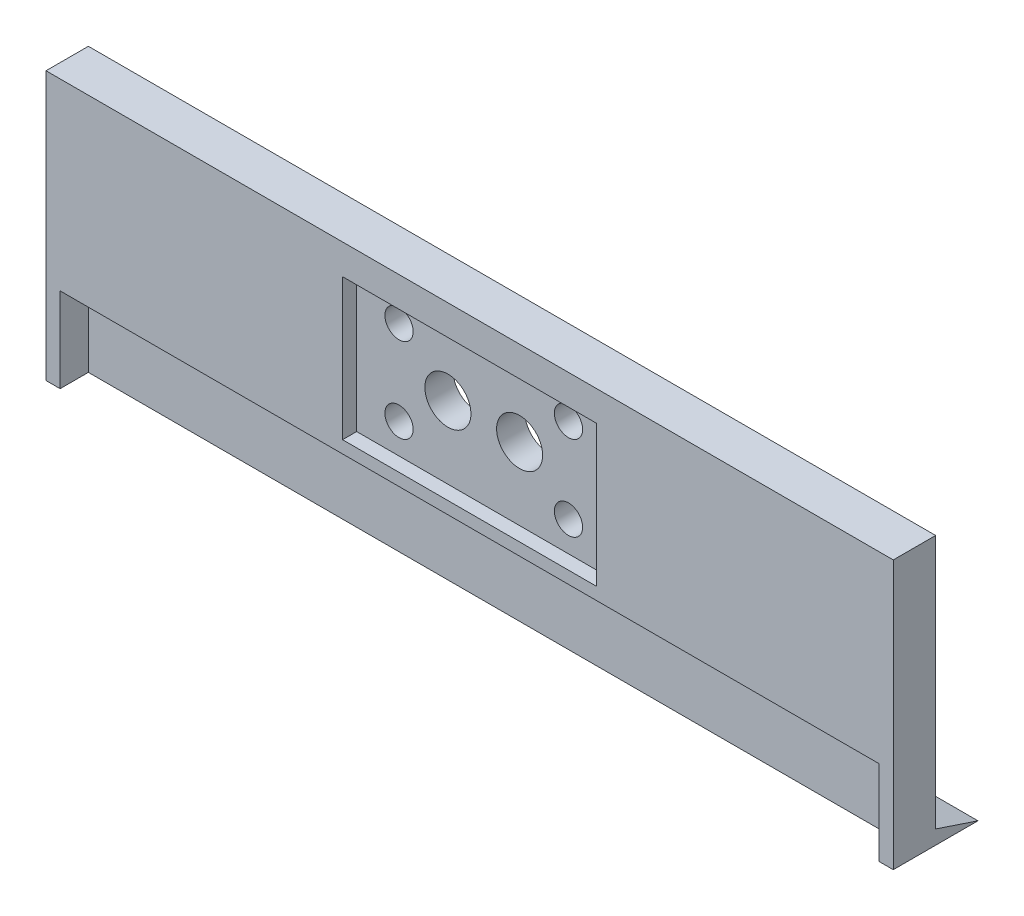
ISO-10303-21;
HEADER;
FILE_DESCRIPTION(('STEP AP214'),'2;1');
FILE_NAME('part.step','',(''),(''),'','','');
FILE_SCHEMA(('AUTOMOTIVE_DESIGN { 1 0 10303 214 1 1 1 1 }'));
ENDSEC;
DATA;
#1=APPLICATION_CONTEXT('core data for automotive mechanical design processes');
#2=APPLICATION_PROTOCOL_DEFINITION('international standard','automotive_design',2000,#1);
#3=PRODUCT_CONTEXT('',#1,'mechanical');
#4=PRODUCT('Part','Part','',(#3));
#5=PRODUCT_RELATED_PRODUCT_CATEGORY('part','',(#4));
#6=PRODUCT_DEFINITION_FORMATION('','',#4);
#7=PRODUCT_DEFINITION_CONTEXT('part definition',#1,'design');
#8=PRODUCT_DEFINITION('design','',#6,#7);
#9=PRODUCT_DEFINITION_SHAPE('','',#8);
#10=(LENGTH_UNIT() NAMED_UNIT(*) SI_UNIT(.MILLI.,.METRE.));
#11=(NAMED_UNIT(*) PLANE_ANGLE_UNIT() SI_UNIT($,.RADIAN.));
#12=(NAMED_UNIT(*) SI_UNIT($,.STERADIAN.) SOLID_ANGLE_UNIT());
#13=UNCERTAINTY_MEASURE_WITH_UNIT(LENGTH_MEASURE(1.E-05),#10,'distance_accuracy_value','');
#14=(GEOMETRIC_REPRESENTATION_CONTEXT(3) GLOBAL_UNCERTAINTY_ASSIGNED_CONTEXT((#13)) GLOBAL_UNIT_ASSIGNED_CONTEXT((#10,
#11,#12)) REPRESENTATION_CONTEXT('',''));
#15=CARTESIAN_POINT('',(0.,0.,0.));
#16=DIRECTION('',(0.,0.,1.));
#17=DIRECTION('',(1.,0.,0.));
#18=AXIS2_PLACEMENT_3D('',#15,#16,#17);
#19=CARTESIAN_POINT('',(162.7,60.,15.));
#20=DIRECTION('',(0.,0.,-1.));
#21=DIRECTION('',(-1.,0.,0.));
#22=AXIS2_PLACEMENT_3D('',#19,#20,#21);
#23=CYLINDRICAL_SURFACE('',#22,8.15000000000003);
#24=CARTESIAN_POINT('',(162.7,60.,0.));
#25=DIRECTION('',(0.,0.,-1.));
#26=DIRECTION('',(-1.,0.,0.));
#27=AXIS2_PLACEMENT_3D('',#24,#25,#26);
#28=CIRCLE('',#27,8.15000000000003);
#29=CARTESIAN_POINT('',(154.55,60.,0.));
#30=VERTEX_POINT('',#29);
#31=EDGE_CURVE('E228',#30,#30,#28,.T.);
#32=ORIENTED_EDGE('',*,*,#31,.T.);
#33=EDGE_LOOP('',(#32));
#34=FACE_BOUND('',#33,.T.);
#35=CARTESIAN_POINT('',(162.7,60.,10.));
#36=DIRECTION('',(0.,0.,1.));
#37=DIRECTION('',(1.,0.,0.));
#38=AXIS2_PLACEMENT_3D('',#35,#36,#37);
#39=CIRCLE('',#38,8.15000000000003);
#40=CARTESIAN_POINT('',(170.85,60.,10.));
#41=VERTEX_POINT('',#40);
#42=EDGE_CURVE('E193',#41,#41,#39,.F.);
#43=ORIENTED_EDGE('',*,*,#42,.F.);
#44=EDGE_LOOP('',(#43));
#45=FACE_BOUND('',#44,.T.);
#46=ADVANCED_FACE('F46',(#34,#45),#23,.F.);
#47=CARTESIAN_POINT('',(137.3,60.,15.));
#48=DIRECTION('',(0.,0.,-1.));
#49=DIRECTION('',(-1.,0.,0.));
#50=AXIS2_PLACEMENT_3D('',#47,#48,#49);
#51=CYLINDRICAL_SURFACE('',#50,8.15);
#52=CARTESIAN_POINT('',(137.3,60.,0.));
#53=DIRECTION('',(0.,0.,-1.));
#54=DIRECTION('',(-1.,0.,0.));
#55=AXIS2_PLACEMENT_3D('',#52,#53,#54);
#56=CIRCLE('',#55,8.15);
#57=CARTESIAN_POINT('',(129.15,60.,0.));
#58=VERTEX_POINT('',#57);
#59=EDGE_CURVE('E225',#58,#58,#56,.T.);
#60=ORIENTED_EDGE('',*,*,#59,.T.);
#61=EDGE_LOOP('',(#60));
#62=FACE_BOUND('',#61,.T.);
#63=CARTESIAN_POINT('',(137.3,60.,10.));
#64=DIRECTION('',(0.,0.,1.));
#65=DIRECTION('',(1.,0.,0.));
#66=AXIS2_PLACEMENT_3D('',#63,#64,#65);
#67=CIRCLE('',#66,8.15);
#68=CARTESIAN_POINT('',(145.45,60.,10.));
#69=VERTEX_POINT('',#68);
#70=EDGE_CURVE('E190',#69,#69,#67,.F.);
#71=ORIENTED_EDGE('',*,*,#70,.F.);
#72=EDGE_LOOP('',(#71));
#73=FACE_BOUND('',#72,.T.);
#74=ADVANCED_FACE('F338',(#62,#73),#51,.F.);
#75=CARTESIAN_POINT('',(180.,75.,15.));
#76=DIRECTION('',(0.,0.,-1.));
#77=DIRECTION('',(-1.,0.,0.));
#78=AXIS2_PLACEMENT_3D('',#75,#76,#77);
#79=CYLINDRICAL_SURFACE('',#78,5.00000000000002);
#80=CARTESIAN_POINT('',(180.,75.,0.));
#81=DIRECTION('',(0.,0.,-1.));
#82=DIRECTION('',(-1.,0.,0.));
#83=AXIS2_PLACEMENT_3D('',#80,#81,#82);
#84=CIRCLE('',#83,5.00000000000002);
#85=CARTESIAN_POINT('',(175.,75.,0.));
#86=VERTEX_POINT('',#85);
#87=EDGE_CURVE('E222',#86,#86,#84,.T.);
#88=ORIENTED_EDGE('',*,*,#87,.T.);
#89=EDGE_LOOP('',(#88));
#90=FACE_BOUND('',#89,.T.);
#91=CARTESIAN_POINT('',(180.,75.,10.));
#92=DIRECTION('',(0.,0.,1.));
#93=DIRECTION('',(1.,0.,0.));
#94=AXIS2_PLACEMENT_3D('',#91,#92,#93);
#95=CIRCLE('',#94,5.00000000000002);
#96=CARTESIAN_POINT('',(185.,75.,10.));
#97=VERTEX_POINT('',#96);
#98=EDGE_CURVE('E187',#97,#97,#95,.F.);
#99=ORIENTED_EDGE('',*,*,#98,.F.);
#100=EDGE_LOOP('',(#99));
#101=FACE_BOUND('',#100,.T.);
#102=ADVANCED_FACE('F344',(#90,#101),#79,.F.);
#103=CARTESIAN_POINT('',(180.,45.,15.));
#104=DIRECTION('',(0.,0.,-1.));
#105=DIRECTION('',(-1.,0.,0.));
#106=AXIS2_PLACEMENT_3D('',#103,#104,#105);
#107=CYLINDRICAL_SURFACE('',#106,5.00000000000002);
#108=CARTESIAN_POINT('',(180.,45.,0.));
#109=DIRECTION('',(0.,0.,-1.));
#110=DIRECTION('',(-1.,0.,0.));
#111=AXIS2_PLACEMENT_3D('',#108,#109,#110);
#112=CIRCLE('',#111,5.00000000000002);
#113=CARTESIAN_POINT('',(175.,45.,0.));
#114=VERTEX_POINT('',#113);
#115=EDGE_CURVE('E219',#114,#114,#112,.T.);
#116=ORIENTED_EDGE('',*,*,#115,.T.);
#117=EDGE_LOOP('',(#116));
#118=FACE_BOUND('',#117,.T.);
#119=CARTESIAN_POINT('',(180.,45.,10.));
#120=DIRECTION('',(0.,0.,1.));
#121=DIRECTION('',(1.,0.,0.));
#122=AXIS2_PLACEMENT_3D('',#119,#120,#121);
#123=CIRCLE('',#122,5.00000000000002);
#124=CARTESIAN_POINT('',(185.,45.,10.));
#125=VERTEX_POINT('',#124);
#126=EDGE_CURVE('E184',#125,#125,#123,.F.);
#127=ORIENTED_EDGE('',*,*,#126,.F.);
#128=EDGE_LOOP('',(#127));
#129=FACE_BOUND('',#128,.T.);
#130=ADVANCED_FACE('F431',(#118,#129),#107,.F.);
#131=CARTESIAN_POINT('',(120.,75.,15.));
#132=DIRECTION('',(0.,0.,-1.));
#133=DIRECTION('',(-1.,0.,0.));
#134=AXIS2_PLACEMENT_3D('',#131,#132,#133);
#135=CYLINDRICAL_SURFACE('',#134,5.00000000000001);
#136=CARTESIAN_POINT('',(120.,75.,0.));
#137=DIRECTION('',(0.,0.,-1.));
#138=DIRECTION('',(-1.,0.,0.));
#139=AXIS2_PLACEMENT_3D('',#136,#137,#138);
#140=CIRCLE('',#139,5.00000000000001);
#141=CARTESIAN_POINT('',(115.,75.,0.));
#142=VERTEX_POINT('',#141);
#143=EDGE_CURVE('E216',#142,#142,#140,.T.);
#144=ORIENTED_EDGE('',*,*,#143,.T.);
#145=EDGE_LOOP('',(#144));
#146=FACE_BOUND('',#145,.T.);
#147=CARTESIAN_POINT('',(120.,75.,10.));
#148=DIRECTION('',(0.,0.,1.));
#149=DIRECTION('',(1.,0.,0.));
#150=AXIS2_PLACEMENT_3D('',#147,#148,#149);
#151=CIRCLE('',#150,5.00000000000001);
#152=CARTESIAN_POINT('',(125.,75.,10.));
#153=VERTEX_POINT('',#152);
#154=EDGE_CURVE('E181',#153,#153,#151,.F.);
#155=ORIENTED_EDGE('',*,*,#154,.F.);
#156=EDGE_LOOP('',(#155));
#157=FACE_BOUND('',#156,.T.);
#158=ADVANCED_FACE('F421',(#146,#157),#135,.F.);
#159=CARTESIAN_POINT('',(120.,45.,15.));
#160=DIRECTION('',(0.,0.,-1.));
#161=DIRECTION('',(-1.,0.,0.));
#162=AXIS2_PLACEMENT_3D('',#159,#160,#161);
#163=CYLINDRICAL_SURFACE('',#162,5.00000000000001);
#164=CARTESIAN_POINT('',(120.,45.,0.));
#165=DIRECTION('',(0.,0.,-1.));
#166=DIRECTION('',(-1.,0.,0.));
#167=AXIS2_PLACEMENT_3D('',#164,#165,#166);
#168=CIRCLE('',#167,5.00000000000001);
#169=CARTESIAN_POINT('',(115.,45.,0.));
#170=VERTEX_POINT('',#169);
#171=EDGE_CURVE('E211',#170,#170,#168,.T.);
#172=ORIENTED_EDGE('',*,*,#171,.T.);
#173=EDGE_LOOP('',(#172));
#174=FACE_BOUND('',#173,.T.);
#175=CARTESIAN_POINT('',(120.,45.,10.));
#176=DIRECTION('',(0.,0.,1.));
#177=DIRECTION('',(1.,0.,0.));
#178=AXIS2_PLACEMENT_3D('',#175,#176,#177);
#179=CIRCLE('',#178,5.00000000000001);
#180=CARTESIAN_POINT('',(125.,45.,10.));
#181=VERTEX_POINT('',#180);
#182=EDGE_CURVE('E50',#181,#181,#179,.F.);
#183=ORIENTED_EDGE('',*,*,#182,.F.);
#184=EDGE_LOOP('',(#183));
#185=FACE_BOUND('',#184,.T.);
#186=ADVANCED_FACE('F357',(#174,#185),#163,.F.);
#187=CARTESIAN_POINT('',(0.,0.,0.));
#188=DIRECTION('',(0.,0.,-1.));
#189=DIRECTION('',(-1.,0.,0.));
#190=AXIS2_PLACEMENT_3D('',#187,#188,#189);
#191=PLANE('',#190);
#192=ORIENTED_EDGE('',*,*,#171,.F.);
#193=EDGE_LOOP('',(#192));
#194=FACE_BOUND('',#193,.T.);
#195=ORIENTED_EDGE('',*,*,#143,.F.);
#196=EDGE_LOOP('',(#195));
#197=FACE_BOUND('',#196,.T.);
#198=ORIENTED_EDGE('',*,*,#115,.F.);
#199=EDGE_LOOP('',(#198));
#200=FACE_BOUND('',#199,.T.);
#201=ORIENTED_EDGE('',*,*,#87,.F.);
#202=EDGE_LOOP('',(#201));
#203=FACE_BOUND('',#202,.T.);
#204=ORIENTED_EDGE('',*,*,#59,.F.);
#205=EDGE_LOOP('',(#204));
#206=FACE_BOUND('',#205,.T.);
#207=ORIENTED_EDGE('',*,*,#31,.F.);
#208=EDGE_LOOP('',(#207));
#209=FACE_BOUND('',#208,.T.);
#210=DIRECTION('',(0.,1.,0.));
#211=VECTOR('',#210,1.);
#212=CARTESIAN_POINT('',(300.,0.,0.));
#213=LINE('',#212,#211);
#214=CARTESIAN_POINT('',(300.,5.,0.));
#215=VERTEX_POINT('',#214);
#216=CARTESIAN_POINT('',(300.,95.,0.));
#217=VERTEX_POINT('',#216);
#218=EDGE_CURVE('E298',#215,#217,#213,.T.);
#219=ORIENTED_EDGE('',*,*,#218,.F.);
#220=DIRECTION('',(-1.,0.,0.));
#221=VECTOR('',#220,1.);
#222=CARTESIAN_POINT('',(315.811388300842,5.,0.));
#223=LINE('',#222,#221);
#224=CARTESIAN_POINT('',(0.,5.,0.));
#225=VERTEX_POINT('',#224);
#226=EDGE_CURVE('E250',#215,#225,#223,.T.);
#227=ORIENTED_EDGE('',*,*,#226,.T.);
#228=DIRECTION('',(0.,-1.,0.));
#229=VECTOR('',#228,1.);
#230=CARTESIAN_POINT('',(0.,0.,0.));
#231=LINE('',#230,#229);
#232=CARTESIAN_POINT('',(0.,95.,0.));
#233=VERTEX_POINT('',#232);
#234=EDGE_CURVE('E259',#233,#225,#231,.T.);
#235=ORIENTED_EDGE('',*,*,#234,.F.);
#236=DIRECTION('',(-1.,0.,0.));
#237=VECTOR('',#236,1.);
#238=CARTESIAN_POINT('',(0.,95.,0.));
#239=LINE('',#238,#237);
#240=EDGE_CURVE('E303',#217,#233,#239,.T.);
#241=ORIENTED_EDGE('',*,*,#240,.F.);
#242=EDGE_LOOP('',(#219,#227,#235,#241));
#243=FACE_BOUND('',#242,.T.);
#244=ADVANCED_FACE('F313',(#194,#197,#200,#203,#206,#209,#243),#191,.T.);
#245=CARTESIAN_POINT('',(0.,0.,5.));
#246=DIRECTION('',(1.,0.,0.));
#247=DIRECTION('',(0.,0.,-1.));
#248=AXIS2_PLACEMENT_3D('',#245,#246,#247);
#249=PLANE('',#248);
#250=ORIENTED_EDGE('',*,*,#234,.T.);
#251=DIRECTION('',(0.,0.316227766016838,0.948683298050514));
#252=VECTOR('',#251,1.);
#253=CARTESIAN_POINT('',(0.,4.5,-1.5));
#254=LINE('',#253,#252);
#255=CARTESIAN_POINT('',(0.,0.,-15.));
#256=VERTEX_POINT('',#255);
#257=EDGE_CURVE('E244',#256,#225,#254,.T.);
#258=ORIENTED_EDGE('',*,*,#257,.F.);
#259=DIRECTION('',(0.,0.,-1.));
#260=VECTOR('',#259,1.);
#261=CARTESIAN_POINT('',(0.,0.,5.));
#262=LINE('',#261,#260);
#263=CARTESIAN_POINT('',(0.,0.,15.));
#264=VERTEX_POINT('',#263);
#265=EDGE_CURVE('E264',#264,#256,#262,.T.);
#266=ORIENTED_EDGE('',*,*,#265,.F.);
#267=DIRECTION('',(0.,-1.,0.));
#268=VECTOR('',#267,1.);
#269=CARTESIAN_POINT('',(0.,0.,15.));
#270=LINE('',#269,#268);
#271=CARTESIAN_POINT('',(0.,95.,15.));
#272=VERTEX_POINT('',#271);
#273=EDGE_CURVE('E234',#272,#264,#270,.T.);
#274=ORIENTED_EDGE('',*,*,#273,.F.);
#275=DIRECTION('',(0.,0.,-1.));
#276=VECTOR('',#275,1.);
#277=CARTESIAN_POINT('',(0.,95.,5.));
#278=LINE('',#277,#276);
#279=EDGE_CURVE('E286',#272,#233,#278,.T.);
#280=ORIENTED_EDGE('',*,*,#279,.T.);
#281=EDGE_LOOP('',(#250,#258,#266,#274,#280));
#282=FACE_BOUND('',#281,.T.);
#283=ADVANCED_FACE('F48',(#282),#249,.F.);
#284=CARTESIAN_POINT('',(0.,0.,5.));
#285=DIRECTION('',(0.,1.,0.));
#286=DIRECTION('',(0.,0.,1.));
#287=AXIS2_PLACEMENT_3D('',#284,#285,#286);
#288=PLANE('',#287);
#289=DIRECTION('',(1.,0.,0.));
#290=VECTOR('',#289,1.);
#291=CARTESIAN_POINT('',(0.,0.,15.));
#292=LINE('',#291,#290);
#293=CARTESIAN_POINT('',(295.,0.,15.));
#294=VERTEX_POINT('',#293);
#295=CARTESIAN_POINT('',(300.,0.,15.));
#296=VERTEX_POINT('',#295);
#297=EDGE_CURVE('E237',#294,#296,#292,.T.);
#298=ORIENTED_EDGE('',*,*,#297,.F.);
#299=DIRECTION('',(0.,0.,1.));
#300=VECTOR('',#299,1.);
#301=CARTESIAN_POINT('',(295.,0.,28.0208625035403));
#302=LINE('',#301,#300);
#303=CARTESIAN_POINT('',(295.,0.,5.));
#304=VERTEX_POINT('',#303);
#305=EDGE_CURVE('E196',#304,#294,#302,.T.);
#306=ORIENTED_EDGE('',*,*,#305,.F.);
#307=DIRECTION('',(1.,0.,0.));
#308=VECTOR('',#307,1.);
#309=CARTESIAN_POINT('',(295.,0.,5.));
#310=LINE('',#309,#308);
#311=CARTESIAN_POINT('',(5.,0.,4.99999999999996));
#312=VERTEX_POINT('',#311);
#313=EDGE_CURVE('E199',#312,#304,#310,.T.);
#314=ORIENTED_EDGE('',*,*,#313,.F.);
#315=DIRECTION('',(0.,0.,-1.));
#316=VECTOR('',#315,1.);
#317=CARTESIAN_POINT('',(5.,0.,28.0208625035403));
#318=LINE('',#317,#316);
#319=CARTESIAN_POINT('',(5.,0.,15.));
#320=VERTEX_POINT('',#319);
#321=EDGE_CURVE('E205',#320,#312,#318,.T.);
#322=ORIENTED_EDGE('',*,*,#321,.F.);
#323=EDGE_CURVE('E238',#264,#320,#292,.T.);
#324=ORIENTED_EDGE('',*,*,#323,.F.);
#325=ORIENTED_EDGE('',*,*,#265,.T.);
#326=DIRECTION('',(-1.,0.,0.));
#327=VECTOR('',#326,1.);
#328=CARTESIAN_POINT('',(315.811388300842,0.,-15.));
#329=LINE('',#328,#327);
#330=CARTESIAN_POINT('',(300.,0.,-15.));
#331=VERTEX_POINT('',#330);
#332=EDGE_CURVE('E247',#331,#256,#329,.T.);
#333=ORIENTED_EDGE('',*,*,#332,.F.);
#334=DIRECTION('',(0.,0.,-1.));
#335=VECTOR('',#334,1.);
#336=CARTESIAN_POINT('',(300.,0.,5.));
#337=LINE('',#336,#335);
#338=EDGE_CURVE('E291',#296,#331,#337,.T.);
#339=ORIENTED_EDGE('',*,*,#338,.F.);
#340=EDGE_LOOP('',(#298,#306,#314,#322,#324,#325,#333,#339));
#341=FACE_BOUND('',#340,.T.);
#342=ADVANCED_FACE('F277',(#341),#288,.F.);
#343=CARTESIAN_POINT('',(300.,0.,5.));
#344=DIRECTION('',(-1.,0.,0.));
#345=DIRECTION('',(0.,0.,1.));
#346=AXIS2_PLACEMENT_3D('',#343,#344,#345);
#347=PLANE('',#346);
#348=ORIENTED_EDGE('',*,*,#338,.T.);
#349=DIRECTION('',(0.,-0.316227766016838,-0.948683298050514));
#350=VECTOR('',#349,1.);
#351=CARTESIAN_POINT('',(300.,4.5,-1.5));
#352=LINE('',#351,#350);
#353=EDGE_CURVE('E254',#215,#331,#352,.T.);
#354=ORIENTED_EDGE('',*,*,#353,.F.);
#355=ORIENTED_EDGE('',*,*,#218,.T.);
#356=DIRECTION('',(0.,0.,-1.));
#357=VECTOR('',#356,1.);
#358=CARTESIAN_POINT('',(300.,95.,5.));
#359=LINE('',#358,#357);
#360=CARTESIAN_POINT('',(300.,95.,15.));
#361=VERTEX_POINT('',#360);
#362=EDGE_CURVE('E293',#361,#217,#359,.T.);
#363=ORIENTED_EDGE('',*,*,#362,.F.);
#364=DIRECTION('',(0.,1.,0.));
#365=VECTOR('',#364,1.);
#366=CARTESIAN_POINT('',(300.,0.,15.));
#367=LINE('',#366,#365);
#368=EDGE_CURVE('E241',#296,#361,#367,.T.);
#369=ORIENTED_EDGE('',*,*,#368,.F.);
#370=EDGE_LOOP('',(#348,#354,#355,#363,#369));
#371=FACE_BOUND('',#370,.T.);
#372=ADVANCED_FACE('F318',(#371),#347,.F.);
#373=CARTESIAN_POINT('',(0.,95.,5.));
#374=DIRECTION('',(0.,-1.,0.));
#375=DIRECTION('',(0.,0.,-1.));
#376=AXIS2_PLACEMENT_3D('',#373,#374,#375);
#377=PLANE('',#376);
#378=ORIENTED_EDGE('',*,*,#240,.T.);
#379=ORIENTED_EDGE('',*,*,#279,.F.);
#380=DIRECTION('',(-1.,0.,0.));
#381=VECTOR('',#380,1.);
#382=CARTESIAN_POINT('',(0.,95.,15.));
#383=LINE('',#382,#381);
#384=EDGE_CURVE('E231',#361,#272,#383,.T.);
#385=ORIENTED_EDGE('',*,*,#384,.F.);
#386=ORIENTED_EDGE('',*,*,#362,.T.);
#387=EDGE_LOOP('',(#378,#379,#385,#386));
#388=FACE_BOUND('',#387,.T.);
#389=ADVANCED_FACE('F308',(#388),#377,.F.);
#390=CARTESIAN_POINT('',(315.811388300842,4.5,-1.5));
#391=DIRECTION('',(0.,-0.948683298050514,0.316227766016838));
#392=DIRECTION('',(0.,-0.316227766016838,-0.948683298050514));
#393=AXIS2_PLACEMENT_3D('',#390,#391,#392);
#394=PLANE('',#393);
#395=ORIENTED_EDGE('',*,*,#226,.F.);
#396=ORIENTED_EDGE('',*,*,#353,.T.);
#397=ORIENTED_EDGE('',*,*,#332,.T.);
#398=ORIENTED_EDGE('',*,*,#257,.T.);
#399=EDGE_LOOP('',(#395,#396,#397,#398));
#400=FACE_BOUND('',#399,.T.);
#401=ADVANCED_FACE('F316',(#400),#394,.F.);
#402=CARTESIAN_POINT('',(0.,0.,15.));
#403=DIRECTION('',(0.,0.,1.));
#404=DIRECTION('',(1.,0.,0.));
#405=AXIS2_PLACEMENT_3D('',#402,#403,#404);
#406=PLANE('',#405);
#407=DIRECTION('',(0.,-1.,0.));
#408=VECTOR('',#407,1.);
#409=CARTESIAN_POINT('',(105.,84.3608471303744,15.));
#410=LINE('',#409,#408);
#411=CARTESIAN_POINT('',(105.,84.3608471303744,15.));
#412=VERTEX_POINT('',#411);
#413=CARTESIAN_POINT('',(105.,34.3608471303744,15.));
#414=VERTEX_POINT('',#413);
#415=EDGE_CURVE('E62',#412,#414,#410,.T.);
#416=ORIENTED_EDGE('',*,*,#415,.F.);
#417=DIRECTION('',(-1.,0.,0.));
#418=VECTOR('',#417,1.);
#419=CARTESIAN_POINT('',(105.,84.3608471303744,15.));
#420=LINE('',#419,#418);
#421=CARTESIAN_POINT('',(195.,84.3608471303744,15.));
#422=VERTEX_POINT('',#421);
#423=EDGE_CURVE('E163',#422,#412,#420,.T.);
#424=ORIENTED_EDGE('',*,*,#423,.F.);
#425=DIRECTION('',(0.,1.,0.));
#426=VECTOR('',#425,1.);
#427=CARTESIAN_POINT('',(195.,84.3608471303744,15.));
#428=LINE('',#427,#426);
#429=CARTESIAN_POINT('',(195.,34.3608471303744,15.));
#430=VERTEX_POINT('',#429);
#431=EDGE_CURVE('E166',#430,#422,#428,.T.);
#432=ORIENTED_EDGE('',*,*,#431,.F.);
#433=DIRECTION('',(1.,0.,0.));
#434=VECTOR('',#433,1.);
#435=CARTESIAN_POINT('',(105.,34.3608471303744,15.));
#436=LINE('',#435,#434);
#437=EDGE_CURVE('E172',#414,#430,#436,.T.);
#438=ORIENTED_EDGE('',*,*,#437,.F.);
#439=EDGE_LOOP('',(#416,#424,#432,#438));
#440=FACE_BOUND('',#439,.T.);
#441=DIRECTION('',(0.,1.,0.));
#442=VECTOR('',#441,1.);
#443=CARTESIAN_POINT('',(295.,0.,15.));
#444=LINE('',#443,#442);
#445=CARTESIAN_POINT('',(295.,30.,15.));
#446=VERTEX_POINT('',#445);
#447=EDGE_CURVE('E13',#294,#446,#444,.T.);
#448=ORIENTED_EDGE('',*,*,#447,.F.);
#449=ORIENTED_EDGE('',*,*,#297,.T.);
#450=ORIENTED_EDGE('',*,*,#368,.T.);
#451=ORIENTED_EDGE('',*,*,#384,.T.);
#452=ORIENTED_EDGE('',*,*,#273,.T.);
#453=ORIENTED_EDGE('',*,*,#323,.T.);
#454=DIRECTION('',(0.,-1.,0.));
#455=VECTOR('',#454,1.);
#456=CARTESIAN_POINT('',(5.,0.,15.));
#457=LINE('',#456,#455);
#458=CARTESIAN_POINT('',(5.,30.,15.));
#459=VERTEX_POINT('',#458);
#460=EDGE_CURVE('E55',#459,#320,#457,.T.);
#461=ORIENTED_EDGE('',*,*,#460,.F.);
#462=DIRECTION('',(-1.,0.,0.));
#463=VECTOR('',#462,1.);
#464=CARTESIAN_POINT('',(0.,30.,15.));
#465=LINE('',#464,#463);
#466=EDGE_CURVE('E262',#446,#459,#465,.T.);
#467=ORIENTED_EDGE('',*,*,#466,.F.);
#468=EDGE_LOOP('',(#448,#449,#450,#451,#452,#453,#461,#467));
#469=FACE_BOUND('',#468,.T.);
#470=ADVANCED_FACE('F280',(#440,#469),#406,.T.);
#471=CARTESIAN_POINT('',(295.,30.,28.0208625035403));
#472=DIRECTION('',(1.,0.,0.));
#473=DIRECTION('',(0.,0.,-1.));
#474=AXIS2_PLACEMENT_3D('',#471,#472,#473);
#475=PLANE('',#474);
#476=ORIENTED_EDGE('',*,*,#447,.T.);
#477=DIRECTION('',(0.,0.,1.));
#478=VECTOR('',#477,1.);
#479=CARTESIAN_POINT('',(295.,30.,28.0208625035403));
#480=LINE('',#479,#478);
#481=CARTESIAN_POINT('',(295.,30.,5.));
#482=VERTEX_POINT('',#481);
#483=EDGE_CURVE('E70',#482,#446,#480,.T.);
#484=ORIENTED_EDGE('',*,*,#483,.F.);
#485=DIRECTION('',(0.,-1.,0.));
#486=VECTOR('',#485,1.);
#487=CARTESIAN_POINT('',(295.,30.,5.));
#488=LINE('',#487,#486);
#489=EDGE_CURVE('E209',#482,#304,#488,.T.);
#490=ORIENTED_EDGE('',*,*,#489,.T.);
#491=ORIENTED_EDGE('',*,*,#305,.T.);
#492=EDGE_LOOP('',(#476,#484,#490,#491));
#493=FACE_BOUND('',#492,.T.);
#494=ADVANCED_FACE('F320',(#493),#475,.F.);
#495=CARTESIAN_POINT('',(295.,30.,5.));
#496=DIRECTION('',(0.,0.,-1.));
#497=DIRECTION('',(-1.,0.,0.));
#498=AXIS2_PLACEMENT_3D('',#495,#496,#497);
#499=PLANE('',#498);
#500=ORIENTED_EDGE('',*,*,#313,.T.);
#501=ORIENTED_EDGE('',*,*,#489,.F.);
#502=DIRECTION('',(1.,0.,0.));
#503=VECTOR('',#502,1.);
#504=CARTESIAN_POINT('',(295.,30.,5.));
#505=LINE('',#504,#503);
#506=CARTESIAN_POINT('',(5.,30.,4.99999999999996));
#507=VERTEX_POINT('',#506);
#508=EDGE_CURVE('E201',#507,#482,#505,.T.);
#509=ORIENTED_EDGE('',*,*,#508,.F.);
#510=DIRECTION('',(0.,-1.,0.));
#511=VECTOR('',#510,1.);
#512=CARTESIAN_POINT('',(5.,30.,4.99999999999996));
#513=LINE('',#512,#511);
#514=EDGE_CURVE('E203',#507,#312,#513,.T.);
#515=ORIENTED_EDGE('',*,*,#514,.T.);
#516=EDGE_LOOP('',(#500,#501,#509,#515));
#517=FACE_BOUND('',#516,.T.);
#518=ADVANCED_FACE('F323',(#517),#499,.F.);
#519=CARTESIAN_POINT('',(5.,30.,28.0208625035403));
#520=DIRECTION('',(-1.,0.,0.));
#521=DIRECTION('',(0.,0.,1.));
#522=AXIS2_PLACEMENT_3D('',#519,#520,#521);
#523=PLANE('',#522);
#524=ORIENTED_EDGE('',*,*,#460,.T.);
#525=ORIENTED_EDGE('',*,*,#321,.T.);
#526=ORIENTED_EDGE('',*,*,#514,.F.);
#527=DIRECTION('',(0.,0.,-1.));
#528=VECTOR('',#527,1.);
#529=CARTESIAN_POINT('',(5.,30.,28.0208625035403));
#530=LINE('',#529,#528);
#531=EDGE_CURVE('E198',#459,#507,#530,.T.);
#532=ORIENTED_EDGE('',*,*,#531,.F.);
#533=EDGE_LOOP('',(#524,#525,#526,#532));
#534=FACE_BOUND('',#533,.T.);
#535=ADVANCED_FACE('F269',(#534),#523,.F.);
#536=CARTESIAN_POINT('',(0.,30.,0.));
#537=DIRECTION('',(0.,1.,0.));
#538=DIRECTION('',(0.,0.,1.));
#539=AXIS2_PLACEMENT_3D('',#536,#537,#538);
#540=PLANE('',#539);
#541=ORIENTED_EDGE('',*,*,#466,.T.);
#542=ORIENTED_EDGE('',*,*,#531,.T.);
#543=ORIENTED_EDGE('',*,*,#508,.T.);
#544=ORIENTED_EDGE('',*,*,#483,.T.);
#545=EDGE_LOOP('',(#541,#542,#543,#544));
#546=FACE_BOUND('',#545,.T.);
#547=ADVANCED_FACE('F324',(#546),#540,.F.);
#548=CARTESIAN_POINT('',(0.,0.,10.));
#549=DIRECTION('',(0.,0.,1.));
#550=DIRECTION('',(1.,0.,0.));
#551=AXIS2_PLACEMENT_3D('',#548,#549,#550);
#552=PLANE('',#551);
#553=ORIENTED_EDGE('',*,*,#70,.T.);
#554=EDGE_LOOP('',(#553));
#555=FACE_BOUND('',#554,.T.);
#556=ORIENTED_EDGE('',*,*,#126,.T.);
#557=EDGE_LOOP('',(#556));
#558=FACE_BOUND('',#557,.T.);
#559=ORIENTED_EDGE('',*,*,#182,.T.);
#560=EDGE_LOOP('',(#559));
#561=FACE_BOUND('',#560,.T.);
#562=DIRECTION('',(0.,-1.,0.));
#563=VECTOR('',#562,1.);
#564=CARTESIAN_POINT('',(105.,84.3608471303744,10.));
#565=LINE('',#564,#563);
#566=CARTESIAN_POINT('',(105.,84.3608471303744,10.));
#567=VERTEX_POINT('',#566);
#568=CARTESIAN_POINT('',(105.,34.3608471303744,10.));
#569=VERTEX_POINT('',#568);
#570=EDGE_CURVE('E144',#567,#569,#565,.T.);
#571=ORIENTED_EDGE('',*,*,#570,.T.);
#572=DIRECTION('',(1.,0.,0.));
#573=VECTOR('',#572,1.);
#574=CARTESIAN_POINT('',(105.,34.3608471303744,10.));
#575=LINE('',#574,#573);
#576=CARTESIAN_POINT('',(195.,34.3608471303744,10.));
#577=VERTEX_POINT('',#576);
#578=EDGE_CURVE('E153',#569,#577,#575,.T.);
#579=ORIENTED_EDGE('',*,*,#578,.T.);
#580=DIRECTION('',(0.,1.,0.));
#581=VECTOR('',#580,1.);
#582=CARTESIAN_POINT('',(195.,84.3608471303744,10.));
#583=LINE('',#582,#581);
#584=CARTESIAN_POINT('',(195.,84.3608471303744,10.));
#585=VERTEX_POINT('',#584);
#586=EDGE_CURVE('E158',#577,#585,#583,.T.);
#587=ORIENTED_EDGE('',*,*,#586,.T.);
#588=DIRECTION('',(-1.,0.,0.));
#589=VECTOR('',#588,1.);
#590=CARTESIAN_POINT('',(105.,84.3608471303744,10.));
#591=LINE('',#590,#589);
#592=EDGE_CURVE('E150',#585,#567,#591,.T.);
#593=ORIENTED_EDGE('',*,*,#592,.T.);
#594=EDGE_LOOP('',(#571,#579,#587,#593));
#595=FACE_BOUND('',#594,.T.);
#596=ORIENTED_EDGE('',*,*,#154,.T.);
#597=EDGE_LOOP('',(#596));
#598=FACE_BOUND('',#597,.T.);
#599=ORIENTED_EDGE('',*,*,#98,.T.);
#600=EDGE_LOOP('',(#599));
#601=FACE_BOUND('',#600,.T.);
#602=ORIENTED_EDGE('',*,*,#42,.T.);
#603=EDGE_LOOP('',(#602));
#604=FACE_BOUND('',#603,.T.);
#605=ADVANCED_FACE('F160',(#555,#558,#561,#595,#598,#601,#604),#552,.T.);
#606=CARTESIAN_POINT('',(105.,84.3608471303744,10.));
#607=DIRECTION('',(-1.,0.,0.));
#608=DIRECTION('',(0.,0.,1.));
#609=AXIS2_PLACEMENT_3D('',#606,#607,#608);
#610=PLANE('',#609);
#611=ORIENTED_EDGE('',*,*,#415,.T.);
#612=DIRECTION('',(0.,0.,1.));
#613=VECTOR('',#612,1.);
#614=CARTESIAN_POINT('',(105.,34.3608471303744,10.));
#615=LINE('',#614,#613);
#616=EDGE_CURVE('E140',#569,#414,#615,.T.);
#617=ORIENTED_EDGE('',*,*,#616,.F.);
#618=ORIENTED_EDGE('',*,*,#570,.F.);
#619=DIRECTION('',(0.,0.,1.));
#620=VECTOR('',#619,1.);
#621=CARTESIAN_POINT('',(105.,84.3608471303744,10.));
#622=LINE('',#621,#620);
#623=EDGE_CURVE('E176',#567,#412,#622,.T.);
#624=ORIENTED_EDGE('',*,*,#623,.T.);
#625=EDGE_LOOP('',(#611,#617,#618,#624));
#626=FACE_BOUND('',#625,.T.);
#627=ADVANCED_FACE('F142',(#626),#610,.F.);
#628=CARTESIAN_POINT('',(105.,84.3608471303744,10.));
#629=DIRECTION('',(0.,1.,0.));
#630=DIRECTION('',(-1.,0.,0.));
#631=AXIS2_PLACEMENT_3D('',#628,#629,#630);
#632=PLANE('',#631);
#633=ORIENTED_EDGE('',*,*,#423,.T.);
#634=ORIENTED_EDGE('',*,*,#623,.F.);
#635=ORIENTED_EDGE('',*,*,#592,.F.);
#636=DIRECTION('',(0.,0.,1.));
#637=VECTOR('',#636,1.);
#638=CARTESIAN_POINT('',(195.,84.3608471303744,10.));
#639=LINE('',#638,#637);
#640=EDGE_CURVE('E178',#585,#422,#639,.T.);
#641=ORIENTED_EDGE('',*,*,#640,.T.);
#642=EDGE_LOOP('',(#633,#634,#635,#641));
#643=FACE_BOUND('',#642,.T.);
#644=ADVANCED_FACE('F473',(#643),#632,.F.);
#645=CARTESIAN_POINT('',(195.,84.3608471303744,10.));
#646=DIRECTION('',(1.,0.,0.));
#647=DIRECTION('',(0.,0.,-1.));
#648=AXIS2_PLACEMENT_3D('',#645,#646,#647);
#649=PLANE('',#648);
#650=ORIENTED_EDGE('',*,*,#431,.T.);
#651=ORIENTED_EDGE('',*,*,#640,.F.);
#652=ORIENTED_EDGE('',*,*,#586,.F.);
#653=DIRECTION('',(0.,0.,1.));
#654=VECTOR('',#653,1.);
#655=CARTESIAN_POINT('',(195.,34.3608471303744,10.));
#656=LINE('',#655,#654);
#657=EDGE_CURVE('E149',#577,#430,#656,.T.);
#658=ORIENTED_EDGE('',*,*,#657,.T.);
#659=EDGE_LOOP('',(#650,#651,#652,#658));
#660=FACE_BOUND('',#659,.T.);
#661=ADVANCED_FACE('F480',(#660),#649,.F.);
#662=CARTESIAN_POINT('',(105.,34.3608471303744,10.));
#663=DIRECTION('',(0.,-1.,0.));
#664=DIRECTION('',(0.,0.,-1.));
#665=AXIS2_PLACEMENT_3D('',#662,#663,#664);
#666=PLANE('',#665);
#667=ORIENTED_EDGE('',*,*,#437,.T.);
#668=ORIENTED_EDGE('',*,*,#657,.F.);
#669=ORIENTED_EDGE('',*,*,#578,.F.);
#670=ORIENTED_EDGE('',*,*,#616,.T.);
#671=EDGE_LOOP('',(#667,#668,#669,#670));
#672=FACE_BOUND('',#671,.T.);
#673=ADVANCED_FACE('F154',(#672),#666,.F.);
#674=CLOSED_SHELL('',(#46,#74,#102,#130,#158,#186,#244,#283,#342,#372,#389,#401,#470,#494,#518,
#535,#547,#605,#627,#644,#661,#673));
#675=MANIFOLD_SOLID_BREP('B2',#674);
#676=ADVANCED_BREP_SHAPE_REPRESENTATION('',(#18,#675),#14);
#677=SHAPE_DEFINITION_REPRESENTATION(#9,#676);
ENDSEC;
END-ISO-10303-21;
